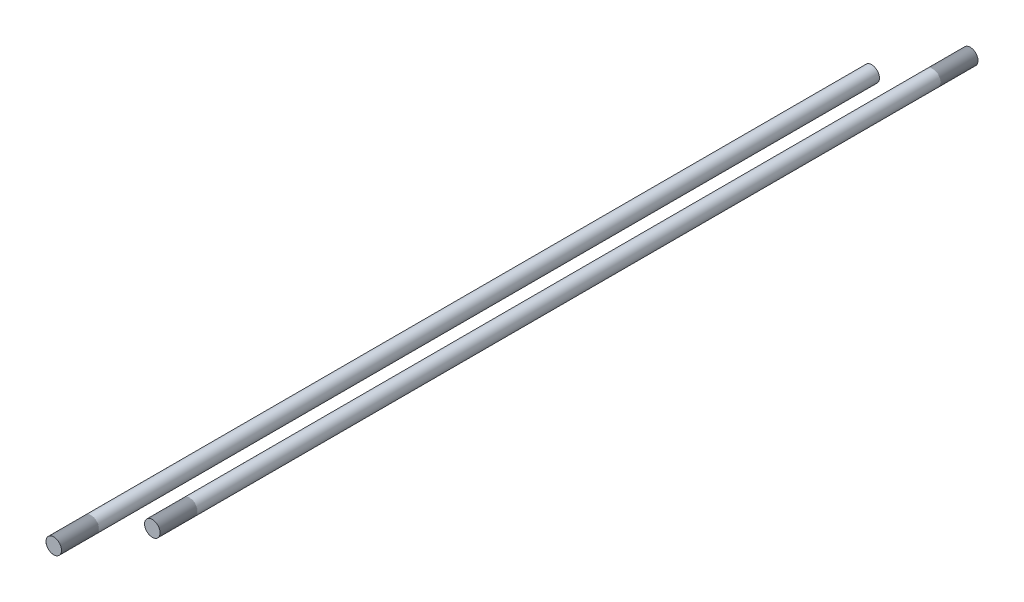
ISO-10303-21;
HEADER;
FILE_DESCRIPTION(('STEP AP214'),'2;1');
FILE_NAME('part.step','',(''),(''),'','','');
FILE_SCHEMA(('AUTOMOTIVE_DESIGN { 1 0 10303 214 1 1 1 1 }'));
ENDSEC;
DATA;
#1=APPLICATION_CONTEXT('core data for automotive mechanical design processes');
#2=APPLICATION_PROTOCOL_DEFINITION('international standard','automotive_design',2000,#1);
#3=PRODUCT_CONTEXT('',#1,'mechanical');
#4=PRODUCT('Part','Part','',(#3));
#5=PRODUCT_RELATED_PRODUCT_CATEGORY('part','',(#4));
#6=PRODUCT_DEFINITION_FORMATION('','',#4);
#7=PRODUCT_DEFINITION_CONTEXT('part definition',#1,'design');
#8=PRODUCT_DEFINITION('design','',#6,#7);
#9=PRODUCT_DEFINITION_SHAPE('','',#8);
#10=(LENGTH_UNIT() NAMED_UNIT(*) SI_UNIT(.MILLI.,.METRE.));
#11=(NAMED_UNIT(*) PLANE_ANGLE_UNIT() SI_UNIT($,.RADIAN.));
#12=(NAMED_UNIT(*) SI_UNIT($,.STERADIAN.) SOLID_ANGLE_UNIT());
#13=UNCERTAINTY_MEASURE_WITH_UNIT(LENGTH_MEASURE(1.E-05),#10,'distance_accuracy_value','');
#14=(GEOMETRIC_REPRESENTATION_CONTEXT(3) GLOBAL_UNCERTAINTY_ASSIGNED_CONTEXT((#13)) GLOBAL_UNIT_ASSIGNED_CONTEXT((#10,
#11,#12)) REPRESENTATION_CONTEXT('',''));
#15=CARTESIAN_POINT('',(0.,0.,0.));
#16=DIRECTION('',(0.,0.,1.));
#17=DIRECTION('',(1.,0.,0.));
#18=AXIS2_PLACEMENT_3D('',#15,#16,#17);
#19=CARTESIAN_POINT('',(0.,0.,-15.24));
#20=DIRECTION('',(0.,0.,-1.));
#21=DIRECTION('',(-1.,0.,0.));
#22=AXIS2_PLACEMENT_3D('',#19,#20,#21);
#23=PLANE('',#22);
#24=CARTESIAN_POINT('',(-40.4098440343161,-26.400791933361,-15.24));
#25=DIRECTION('',(0.,0.,-1.));
#26=DIRECTION('',(-1.,0.,0.));
#27=AXIS2_PLACEMENT_3D('',#24,#25,#26);
#28=CIRCLE('',#27,3.17499999999997);
#29=CARTESIAN_POINT('',(-37.2348440343161,-26.400791933361,-15.24));
#30=VERTEX_POINT('',#29);
#31=EDGE_CURVE('E11',#30,#30,#28,.F.);
#32=ORIENTED_EDGE('',*,*,#31,.F.);
#33=EDGE_LOOP('',(#32));
#34=FACE_BOUND('',#33,.T.);
#35=ADVANCED_FACE('F44',(#34),#23,.T.);
#36=CARTESIAN_POINT('',(-40.4098440343161,-26.400791933361,320.039999999997));
#37=DIRECTION('',(0.,0.,1.));
#38=DIRECTION('',(1.,0.,0.));
#39=AXIS2_PLACEMENT_3D('',#36,#37,#38);
#40=PLANE('',#39);
#41=CARTESIAN_POINT('',(-40.4098440343161,-26.400791933361,320.039999999997));
#42=DIRECTION('',(0.,0.,1.));
#43=DIRECTION('',(1.,0.,0.));
#44=AXIS2_PLACEMENT_3D('',#41,#42,#43);
#45=CIRCLE('',#44,3.17499999999997);
#46=CARTESIAN_POINT('',(-37.2348440343161,-26.400791933361,320.039999999997));
#47=VERTEX_POINT('',#46);
#48=EDGE_CURVE('E50',#47,#47,#45,.T.);
#49=ORIENTED_EDGE('',*,*,#48,.T.);
#50=EDGE_LOOP('',(#49));
#51=FACE_BOUND('',#50,.T.);
#52=ADVANCED_FACE('F56',(#51),#40,.T.);
#53=CARTESIAN_POINT('',(-40.4098440343161,-26.400791933361,-24.2202561211637));
#54=DIRECTION('',(0.,0.,1.));
#55=DIRECTION('',(1.,0.,0.));
#56=AXIS2_PLACEMENT_3D('',#53,#54,#55);
#57=CYLINDRICAL_SURFACE('',#56,3.17499999999997);
#58=CARTESIAN_POINT('',(-37.2348440343161,-26.400791933361,320.039999999997));
#59=CARTESIAN_POINT('',(-37.2348440343161,-26.400791933361,316.547499999997));
#60=CARTESIAN_POINT('',(-37.2348440343161,-26.400791933361,313.054999999997));
#61=CARTESIAN_POINT('',(-37.2348440343161,-26.400791933361,306.069999999997));
#62=CARTESIAN_POINT('',(-37.2348440343161,-26.400791933361,302.577499999997));
#63=CARTESIAN_POINT('',(-37.2348440343161,-26.400791933361,295.592499999997));
#64=CARTESIAN_POINT('',(-37.2348440343161,-26.400791933361,292.099999999997));
#65=CARTESIAN_POINT('',(-37.2348440343161,-26.400791933361,285.114999999997));
#66=CARTESIAN_POINT('',(-37.2348440343161,-26.400791933361,281.622499999997));
#67=CARTESIAN_POINT('',(-37.2348440343161,-26.400791933361,274.637499999997));
#68=CARTESIAN_POINT('',(-37.2348440343161,-26.400791933361,271.144999999997));
#69=CARTESIAN_POINT('',(-37.2348440343161,-26.400791933361,264.159999999997));
#70=CARTESIAN_POINT('',(-37.2348440343161,-26.400791933361,260.667499999997));
#71=CARTESIAN_POINT('',(-37.2348440343161,-26.400791933361,253.682499999998));
#72=CARTESIAN_POINT('',(-37.2348440343161,-26.400791933361,250.189999999998));
#73=CARTESIAN_POINT('',(-37.2348440343161,-26.400791933361,243.204999999998));
#74=CARTESIAN_POINT('',(-37.2348440343161,-26.400791933361,239.712499999998));
#75=CARTESIAN_POINT('',(-37.2348440343161,-26.400791933361,232.727499999998));
#76=CARTESIAN_POINT('',(-37.2348440343161,-26.400791933361,229.234999999998));
#77=CARTESIAN_POINT('',(-37.2348440343161,-26.400791933361,222.249999999998));
#78=CARTESIAN_POINT('',(-37.2348440343161,-26.400791933361,218.757499999998));
#79=CARTESIAN_POINT('',(-37.2348440343161,-26.400791933361,211.772499999998));
#80=CARTESIAN_POINT('',(-37.2348440343161,-26.400791933361,208.279999999998));
#81=CARTESIAN_POINT('',(-37.2348440343161,-26.400791933361,201.294999999998));
#82=CARTESIAN_POINT('',(-37.2348440343161,-26.400791933361,197.802499999998));
#83=CARTESIAN_POINT('',(-37.2348440343161,-26.400791933361,190.817499999998));
#84=CARTESIAN_POINT('',(-37.2348440343161,-26.400791933361,187.324999999998));
#85=CARTESIAN_POINT('',(-37.2348440343161,-26.400791933361,180.339999999998));
#86=CARTESIAN_POINT('',(-37.2348440343161,-26.400791933361,176.847499999998));
#87=CARTESIAN_POINT('',(-37.2348440343161,-26.400791933361,169.862499999998));
#88=CARTESIAN_POINT('',(-37.2348440343161,-26.400791933361,166.369999999998));
#89=CARTESIAN_POINT('',(-37.2348440343161,-26.400791933361,159.384999999998));
#90=CARTESIAN_POINT('',(-37.2348440343161,-26.400791933361,155.892499999998));
#91=CARTESIAN_POINT('',(-37.2348440343161,-26.400791933361,148.907499999998));
#92=CARTESIAN_POINT('',(-37.2348440343161,-26.400791933361,145.414999999999));
#93=CARTESIAN_POINT('',(-37.2348440343161,-26.400791933361,138.429999999999));
#94=CARTESIAN_POINT('',(-37.2348440343161,-26.400791933361,134.937499999999));
#95=CARTESIAN_POINT('',(-37.2348440343161,-26.400791933361,127.952499999999));
#96=CARTESIAN_POINT('',(-37.2348440343161,-26.400791933361,124.459999999999));
#97=CARTESIAN_POINT('',(-37.2348440343161,-26.400791933361,117.474999999999));
#98=CARTESIAN_POINT('',(-37.2348440343161,-26.400791933361,113.982499999999));
#99=CARTESIAN_POINT('',(-37.2348440343161,-26.400791933361,106.997499999999));
#100=CARTESIAN_POINT('',(-37.2348440343161,-26.400791933361,103.504999999999));
#101=CARTESIAN_POINT('',(-37.2348440343161,-26.400791933361,96.519999999999));
#102=CARTESIAN_POINT('',(-37.2348440343161,-26.400791933361,93.027499999999));
#103=CARTESIAN_POINT('',(-37.2348440343161,-26.400791933361,86.0424999999991));
#104=CARTESIAN_POINT('',(-37.2348440343161,-26.400791933361,82.5499999999991));
#105=CARTESIAN_POINT('',(-37.2348440343161,-26.400791933361,75.5649999999992));
#106=CARTESIAN_POINT('',(-37.2348440343161,-26.400791933361,72.0724999999992));
#107=CARTESIAN_POINT('',(-37.2348440343161,-26.400791933361,65.0874999999993));
#108=CARTESIAN_POINT('',(-37.2348440343161,-26.400791933361,61.5949999999993));
#109=CARTESIAN_POINT('',(-37.2348440343161,-26.400791933361,54.6099999999993));
#110=CARTESIAN_POINT('',(-37.2348440343161,-26.400791933361,51.1174999999994));
#111=CARTESIAN_POINT('',(-37.2348440343161,-26.400791933361,44.1324999999995));
#112=CARTESIAN_POINT('',(-37.2348440343161,-26.400791933361,40.6399999999995));
#113=CARTESIAN_POINT('',(-37.2348440343161,-26.400791933361,33.6549999999996));
#114=CARTESIAN_POINT('',(-37.2348440343161,-26.400791933361,30.1624999999996));
#115=CARTESIAN_POINT('',(-37.2348440343161,-26.400791933361,23.1774999999997));
#116=CARTESIAN_POINT('',(-37.2348440343161,-26.400791933361,19.6849999999997));
#117=CARTESIAN_POINT('',(-37.2348440343161,-26.400791933361,12.6999999999998));
#118=CARTESIAN_POINT('',(-37.2348440343161,-26.400791933361,9.20749999999981));
#119=CARTESIAN_POINT('',(-37.2348440343161,-26.400791933361,2.22249999999988));
#120=CARTESIAN_POINT('',(-37.2348440343161,-26.400791933361,-1.27000000000009));
#121=CARTESIAN_POINT('',(-37.2348440343161,-26.400791933361,-8.25500000000003));
#122=CARTESIAN_POINT('',(-37.2348440343161,-26.400791933361,-11.7475));
#123=CARTESIAN_POINT('',(-37.2348440343161,-26.400791933361,-15.24));
#124=B_SPLINE_CURVE_WITH_KNOTS('',3,(#58,#59,#60,#61,#62,#63,#64,#65,#66,#67,#68,#69,#70,#71,
#72,#73,#74,#75,#76,#77,#78,#79,#80,#81,#82,#83,#84,#85,#86,#87,#88,#89,#90,#91,#92,#93,#94,#95,
#96,#97,#98,#99,#100,#101,#102,#103,#104,#105,#106,#107,#108,#109,#110,#111,#112,#113,#114,#115,
#116,#117,#118,#119,#120,#121,#122,#123),.UNSPECIFIED.,.F.,.F.,(4,2,2,2,2,2,2,2,2,2,2,2,2,2,2,2,
2,2,2,2,2,2,2,2,2,2,2,2,2,2,2,2,4),(0.,10.4774999999999,20.9549999999998,31.4324999999997,
41.9099999999996,52.3874999999995,62.8649999999994,73.3424999999993,83.8199999999992,
94.2974999999991,104.774999999999,115.252499999999,125.729999999999,136.207499999999,
146.684999999999,157.162499999999,167.639999999998,178.117499999998,188.594999999998,
199.072499999998,209.549999999998,220.027499999998,230.504999999998,240.982499999998,
251.459999999998,261.937499999998,272.414999999997,282.892499999997,293.369999999997,
303.847499999997,314.324999999997,324.802499999997,335.279999999997),.UNSPECIFIED.);
#125=EDGE_CURVE('BSEAM58',#47,#30,#124,.T.);
#126=ORIENTED_EDGE('',*,*,#48,.F.);
#127=ORIENTED_EDGE('',*,*,#31,.T.);
#128=ORIENTED_EDGE('',*,*,#125,.T.);
#129=ORIENTED_EDGE('',*,*,#125,.F.);
#130=EDGE_LOOP('',(#126,#128,#127,#129));
#131=FACE_BOUND('',#130,.T.);
#132=ADVANCED_FACE('F58',(#131),#57,.T.);
#133=CLOSED_SHELL('',(#35,#52,#132));
#134=MANIFOLD_SOLID_BREP('B2',#133);
#135=CARTESIAN_POINT('',(0.,0.,-15.24));
#136=DIRECTION('',(0.,0.,-1.));
#137=DIRECTION('',(-1.,0.,0.));
#138=AXIS2_PLACEMENT_3D('',#135,#136,#137);
#139=PLANE('',#138);
#140=CARTESIAN_POINT('',(-2.74861946528413E-11,-1.95520015998085E-11,-15.24));
#141=DIRECTION('',(0.,0.,-1.));
#142=DIRECTION('',(-1.,0.,0.));
#143=AXIS2_PLACEMENT_3D('',#140,#141,#142);
#144=CIRCLE('',#143,3.17500000003342);
#145=CARTESIAN_POINT('',(3.17500000000594,-1.95520015998085E-11,-15.24));
#146=VERTEX_POINT('',#145);
#147=EDGE_CURVE('E43',#146,#146,#144,.F.);
#148=ORIENTED_EDGE('',*,*,#147,.F.);
#149=EDGE_LOOP('',(#148));
#150=FACE_BOUND('',#149,.T.);
#151=ADVANCED_FACE('F93',(#150),#139,.T.);
#152=CARTESIAN_POINT('',(-2.74861946528413E-11,-1.95520015998085E-11,320.039999999997));
#153=DIRECTION('',(0.,0.,1.));
#154=DIRECTION('',(1.,0.,0.));
#155=AXIS2_PLACEMENT_3D('',#152,#153,#154);
#156=PLANE('',#155);
#157=CARTESIAN_POINT('',(-2.74861946528413E-11,-1.95520015998085E-11,320.039999999997));
#158=DIRECTION('',(0.,0.,1.));
#159=DIRECTION('',(1.,0.,0.));
#160=AXIS2_PLACEMENT_3D('',#157,#158,#159);
#161=CIRCLE('',#160,3.17500000003342);
#162=CARTESIAN_POINT('',(3.17500000000594,-1.95520015998085E-11,320.039999999997));
#163=VERTEX_POINT('',#162);
#164=EDGE_CURVE('E99',#163,#163,#161,.T.);
#165=ORIENTED_EDGE('',*,*,#164,.T.);
#166=EDGE_LOOP('',(#165));
#167=FACE_BOUND('',#166,.T.);
#168=ADVANCED_FACE('F105',(#167),#156,.T.);
#169=CARTESIAN_POINT('',(-2.74861946528413E-11,-1.95520015998085E-11,-24.2202561211637));
#170=DIRECTION('',(0.,0.,1.));
#171=DIRECTION('',(1.,0.,0.));
#172=AXIS2_PLACEMENT_3D('',#169,#170,#171);
#173=CYLINDRICAL_SURFACE('',#172,3.17500000003342);
#174=CARTESIAN_POINT('',(3.17500000000594,-1.95520015998085E-11,320.039999999997));
#175=CARTESIAN_POINT('',(3.17500000000594,-1.95520015998085E-11,316.547499999997));
#176=CARTESIAN_POINT('',(3.17500000000594,-1.95520015998085E-11,313.054999999997));
#177=CARTESIAN_POINT('',(3.17500000000594,-1.95520015998085E-11,306.069999999997));
#178=CARTESIAN_POINT('',(3.17500000000594,-1.95520015998085E-11,302.577499999997));
#179=CARTESIAN_POINT('',(3.17500000000594,-1.95520015998085E-11,295.592499999997));
#180=CARTESIAN_POINT('',(3.17500000000594,-1.95520015998085E-11,292.099999999997));
#181=CARTESIAN_POINT('',(3.17500000000594,-1.95520015998085E-11,285.114999999997));
#182=CARTESIAN_POINT('',(3.17500000000594,-1.95520015998085E-11,281.622499999997));
#183=CARTESIAN_POINT('',(3.17500000000594,-1.95520015998085E-11,274.637499999997));
#184=CARTESIAN_POINT('',(3.17500000000594,-1.95520015998085E-11,271.144999999997));
#185=CARTESIAN_POINT('',(3.17500000000594,-1.95520015998085E-11,264.159999999997));
#186=CARTESIAN_POINT('',(3.17500000000594,-1.95520015998085E-11,260.667499999997));
#187=CARTESIAN_POINT('',(3.17500000000594,-1.95520015998085E-11,253.682499999998));
#188=CARTESIAN_POINT('',(3.17500000000594,-1.95520015998085E-11,250.189999999998));
#189=CARTESIAN_POINT('',(3.17500000000594,-1.95520015998085E-11,243.204999999998));
#190=CARTESIAN_POINT('',(3.17500000000594,-1.95520015998085E-11,239.712499999998));
#191=CARTESIAN_POINT('',(3.17500000000594,-1.95520015998085E-11,232.727499999998));
#192=CARTESIAN_POINT('',(3.17500000000594,-1.95520015998085E-11,229.234999999998));
#193=CARTESIAN_POINT('',(3.17500000000594,-1.95520015998085E-11,222.249999999998));
#194=CARTESIAN_POINT('',(3.17500000000594,-1.95520015998085E-11,218.757499999998));
#195=CARTESIAN_POINT('',(3.17500000000594,-1.95520015998085E-11,211.772499999998));
#196=CARTESIAN_POINT('',(3.17500000000594,-1.95520015998085E-11,208.279999999998));
#197=CARTESIAN_POINT('',(3.17500000000594,-1.95520015998085E-11,201.294999999998));
#198=CARTESIAN_POINT('',(3.17500000000594,-1.95520015998085E-11,197.802499999998));
#199=CARTESIAN_POINT('',(3.17500000000594,-1.95520015998085E-11,190.817499999998));
#200=CARTESIAN_POINT('',(3.17500000000594,-1.95520015998085E-11,187.324999999998));
#201=CARTESIAN_POINT('',(3.17500000000594,-1.95520015998085E-11,180.339999999998));
#202=CARTESIAN_POINT('',(3.17500000000594,-1.95520015998085E-11,176.847499999998));
#203=CARTESIAN_POINT('',(3.17500000000594,-1.95520015998085E-11,169.862499999998));
#204=CARTESIAN_POINT('',(3.17500000000594,-1.95520015998085E-11,166.369999999998));
#205=CARTESIAN_POINT('',(3.17500000000594,-1.95520015998085E-11,159.384999999998));
#206=CARTESIAN_POINT('',(3.17500000000594,-1.95520015998085E-11,155.892499999998));
#207=CARTESIAN_POINT('',(3.17500000000594,-1.95520015998085E-11,148.907499999998));
#208=CARTESIAN_POINT('',(3.17500000000594,-1.95520015998085E-11,145.414999999999));
#209=CARTESIAN_POINT('',(3.17500000000594,-1.95520015998085E-11,138.429999999999));
#210=CARTESIAN_POINT('',(3.17500000000594,-1.95520015998085E-11,134.937499999999));
#211=CARTESIAN_POINT('',(3.17500000000594,-1.95520015998085E-11,127.952499999999));
#212=CARTESIAN_POINT('',(3.17500000000594,-1.95520015998085E-11,124.459999999999));
#213=CARTESIAN_POINT('',(3.17500000000594,-1.95520015998085E-11,117.474999999999));
#214=CARTESIAN_POINT('',(3.17500000000594,-1.95520015998085E-11,113.982499999999));
#215=CARTESIAN_POINT('',(3.17500000000594,-1.95520015998085E-11,106.997499999999));
#216=CARTESIAN_POINT('',(3.17500000000594,-1.95520015998085E-11,103.504999999999));
#217=CARTESIAN_POINT('',(3.17500000000594,-1.95520015998085E-11,96.519999999999));
#218=CARTESIAN_POINT('',(3.17500000000594,-1.95520015998085E-11,93.027499999999));
#219=CARTESIAN_POINT('',(3.17500000000594,-1.95520015998085E-11,86.0424999999991));
#220=CARTESIAN_POINT('',(3.17500000000594,-1.95520015998085E-11,82.5499999999991));
#221=CARTESIAN_POINT('',(3.17500000000594,-1.95520015998085E-11,75.5649999999992));
#222=CARTESIAN_POINT('',(3.17500000000594,-1.95520015998085E-11,72.0724999999992));
#223=CARTESIAN_POINT('',(3.17500000000594,-1.95520015998085E-11,65.0874999999993));
#224=CARTESIAN_POINT('',(3.17500000000594,-1.95520015998085E-11,61.5949999999993));
#225=CARTESIAN_POINT('',(3.17500000000594,-1.95520015998085E-11,54.6099999999993));
#226=CARTESIAN_POINT('',(3.17500000000594,-1.95520015998085E-11,51.1174999999994));
#227=CARTESIAN_POINT('',(3.17500000000594,-1.95520015998085E-11,44.1324999999995));
#228=CARTESIAN_POINT('',(3.17500000000594,-1.95520015998085E-11,40.6399999999995));
#229=CARTESIAN_POINT('',(3.17500000000594,-1.95520015998085E-11,33.6549999999996));
#230=CARTESIAN_POINT('',(3.17500000000594,-1.95520015998085E-11,30.1624999999996));
#231=CARTESIAN_POINT('',(3.17500000000594,-1.95520015998085E-11,23.1774999999997));
#232=CARTESIAN_POINT('',(3.17500000000594,-1.95520015998085E-11,19.6849999999997));
#233=CARTESIAN_POINT('',(3.17500000000594,-1.95520015998085E-11,12.6999999999998));
#234=CARTESIAN_POINT('',(3.17500000000594,-1.95520015998085E-11,9.20749999999981));
#235=CARTESIAN_POINT('',(3.17500000000594,-1.95520015998085E-11,2.22249999999988));
#236=CARTESIAN_POINT('',(3.17500000000594,-1.95520015998085E-11,-1.27000000000009));
#237=CARTESIAN_POINT('',(3.17500000000594,-1.95520015998085E-11,-8.25500000000003));
#238=CARTESIAN_POINT('',(3.17500000000594,-1.95520015998085E-11,-11.7475));
#239=CARTESIAN_POINT('',(3.17500000000594,-1.95520015998085E-11,-15.24));
#240=B_SPLINE_CURVE_WITH_KNOTS('',3,(#174,#175,#176,#177,#178,#179,#180,#181,#182,#183,#184,
#185,#186,#187,#188,#189,#190,#191,#192,#193,#194,#195,#196,#197,#198,#199,#200,#201,#202,#203,
#204,#205,#206,#207,#208,#209,#210,#211,#212,#213,#214,#215,#216,#217,#218,#219,#220,#221,#222,
#223,#224,#225,#226,#227,#228,#229,#230,#231,#232,#233,#234,#235,#236,#237,#238,#239),
.UNSPECIFIED.,.F.,.F.,(4,2,2,2,2,2,2,2,2,2,2,2,2,2,2,2,2,2,2,2,2,2,2,2,2,2,2,2,2,2,2,2,4),(0.,
10.4774999999999,20.9549999999998,31.4324999999997,41.9099999999996,52.3874999999995,
62.8649999999994,73.3424999999993,83.8199999999992,94.2974999999991,104.774999999999,
115.252499999999,125.729999999999,136.207499999999,146.684999999999,157.162499999999,
167.639999999998,178.117499999998,188.594999999998,199.072499999998,209.549999999998,
220.027499999998,230.504999999998,240.982499999998,251.459999999998,261.937499999998,
272.414999999997,282.892499999997,293.369999999997,303.847499999997,314.324999999997,
324.802499999997,335.279999999997),.UNSPECIFIED.);
#241=EDGE_CURVE('BSEAM107',#163,#146,#240,.T.);
#242=ORIENTED_EDGE('',*,*,#164,.F.);
#243=ORIENTED_EDGE('',*,*,#147,.T.);
#244=ORIENTED_EDGE('',*,*,#241,.T.);
#245=ORIENTED_EDGE('',*,*,#241,.F.);
#246=EDGE_LOOP('',(#242,#244,#243,#245));
#247=FACE_BOUND('',#246,.T.);
#248=ADVANCED_FACE('F107',(#247),#173,.T.);
#249=CLOSED_SHELL('',(#151,#168,#248));
#250=MANIFOLD_SOLID_BREP('B6',#249);
#251=CARTESIAN_POINT('',(-40.4098440343162,-26.400791933361,312.42000000003));
#252=DIRECTION('',(0.,0.,1.));
#253=DIRECTION('',(0.973375064253279,0.229218202352966,0.));
#254=AXIS2_PLACEMENT_3D('',#251,#252,#253);
#255=CYLINDRICAL_SURFACE('',#254,3.175);
#256=CARTESIAN_POINT('',(-40.4098440343162,-26.4007919333609,304.80000000003));
#257=DIRECTION('',(0.,0.,1.));
#258=DIRECTION('',(0.973375064253279,0.229218202352966,0.));
#259=AXIS2_PLACEMENT_3D('',#256,#257,#258);
#260=CIRCLE('',#259,3.175);
#261=CARTESIAN_POINT('',(-37.3193782053121,-25.6730241408902,304.80000000003));
#262=VERTEX_POINT('',#261);
#263=EDGE_CURVE('E146',#262,#262,#260,.T.);
#264=ORIENTED_EDGE('',*,*,#263,.F.);
#265=EDGE_LOOP('',(#264));
#266=FACE_BOUND('',#265,.T.);
#267=CARTESIAN_POINT('',(-40.4098440343161,-26.400791933361,320.04000000003));
#268=DIRECTION('',(0.,0.,1.));
#269=DIRECTION('',(0.973375064253279,0.229218202352966,0.));
#270=AXIS2_PLACEMENT_3D('',#267,#268,#269);
#271=CIRCLE('',#270,3.175);
#272=CARTESIAN_POINT('',(-37.319378205312,-25.6730241408904,320.04000000003));
#273=VERTEX_POINT('',#272);
#274=EDGE_CURVE('E92',#273,#273,#271,.F.);
#275=ORIENTED_EDGE('',*,*,#274,.F.);
#276=EDGE_LOOP('',(#275));
#277=FACE_BOUND('',#276,.T.);
#278=ADVANCED_FACE('F142',(#266,#277),#255,.F.);
#279=OPEN_SHELL('',(#278));
#280=SHELL_BASED_SURFACE_MODEL('B38',(#279));
#281=CARTESIAN_POINT('',(3.36189409644305E-12,-4.2257863874795E-12,312.419999999997));
#282=DIRECTION('',(0.,0.,1.));
#283=DIRECTION('',(-0.582193422162313,-0.813050317748499,0.));
#284=AXIS2_PLACEMENT_3D('',#281,#282,#283);
#285=CYLINDRICAL_SURFACE('',#284,3.175);
#286=CARTESIAN_POINT('',(3.31679128606766E-12,-4.14598910758457E-12,304.799999999997));
#287=DIRECTION('',(0.,0.,1.));
#288=DIRECTION('',(-0.582193422162313,-0.813050317748499,0.));
#289=AXIS2_PLACEMENT_3D('',#286,#287,#288);
#290=CIRCLE('',#289,3.175);
#291=CARTESIAN_POINT('',(-1.84846411536203,-2.58143475885563,304.799999999997));
#292=VERTEX_POINT('',#291);
#293=EDGE_CURVE('E193',#292,#292,#290,.T.);
#294=ORIENTED_EDGE('',*,*,#293,.F.);
#295=EDGE_LOOP('',(#294));
#296=FACE_BOUND('',#295,.T.);
#297=CARTESIAN_POINT('',(3.40699690681845E-12,-4.30905311432639E-12,320.039999999997));
#298=DIRECTION('',(0.,0.,1.));
#299=DIRECTION('',(-0.582193422162313,-0.813050317748499,0.));
#300=AXIS2_PLACEMENT_3D('',#297,#298,#299);
#301=CIRCLE('',#300,3.175);
#302=CARTESIAN_POINT('',(-1.84846411536194,-2.58143475885579,320.039999999997));
#303=VERTEX_POINT('',#302);
#304=EDGE_CURVE('E141',#303,#303,#301,.F.);
#305=ORIENTED_EDGE('',*,*,#304,.F.);
#306=EDGE_LOOP('',(#305));
#307=FACE_BOUND('',#306,.T.);
#308=ADVANCED_FACE('F189',(#296,#307),#285,.F.);
#309=OPEN_SHELL('',(#308));
#310=SHELL_BASED_SURFACE_MODEL('B87',(#309));
#311=CARTESIAN_POINT('',(0.,0.,-7.61999999999998));
#312=DIRECTION('',(0.,0.,-1.));
#313=DIRECTION('',(-1.,0.,0.));
#314=AXIS2_PLACEMENT_3D('',#311,#312,#313);
#315=CYLINDRICAL_SURFACE('',#314,3.175);
#316=CARTESIAN_POINT('',(0.,0.,-15.24));
#317=DIRECTION('',(0.,0.,-1.));
#318=DIRECTION('',(-1.,0.,0.));
#319=AXIS2_PLACEMENT_3D('',#316,#317,#318);
#320=CIRCLE('',#319,3.175);
#321=CARTESIAN_POINT('',(-3.175,0.,-15.24));
#322=VERTEX_POINT('',#321);
#323=EDGE_CURVE('E223',#322,#322,#320,.T.);
#324=ORIENTED_EDGE('',*,*,#323,.T.);
#325=EDGE_LOOP('',(#324));
#326=FACE_BOUND('',#325,.T.);
#327=CARTESIAN_POINT('',(0.,0.,0.));
#328=DIRECTION('',(0.,0.,-1.));
#329=DIRECTION('',(-1.,0.,0.));
#330=AXIS2_PLACEMENT_3D('',#327,#328,#329);
#331=CIRCLE('',#330,3.175);
#332=CARTESIAN_POINT('',(-3.17500000000001,0.,0.));
#333=VERTEX_POINT('',#332);
#334=EDGE_CURVE('E188',#333,#333,#331,.T.);
#335=ORIENTED_EDGE('',*,*,#334,.F.);
#336=EDGE_LOOP('',(#335));
#337=FACE_BOUND('',#336,.T.);
#338=ADVANCED_FACE('F219',(#326,#337),#315,.F.);
#339=OPEN_SHELL('',(#338));
#340=SHELL_BASED_SURFACE_MODEL('B136',(#339));
#341=ADVANCED_BREP_SHAPE_REPRESENTATION('',(#18,#134,#250),#14);
#342=MANIFOLD_SURFACE_SHAPE_REPRESENTATION('',(#18,#280,#310,#340),#14);
#343=SHAPE_REPRESENTATION('',(#18),#14);
#344=SHAPE_DEFINITION_REPRESENTATION(#9,#343);
#345=SHAPE_REPRESENTATION_RELATIONSHIP('','',#343,#341);
#346=SHAPE_REPRESENTATION_RELATIONSHIP('','',#343,#342);
ENDSEC;
END-ISO-10303-21;
